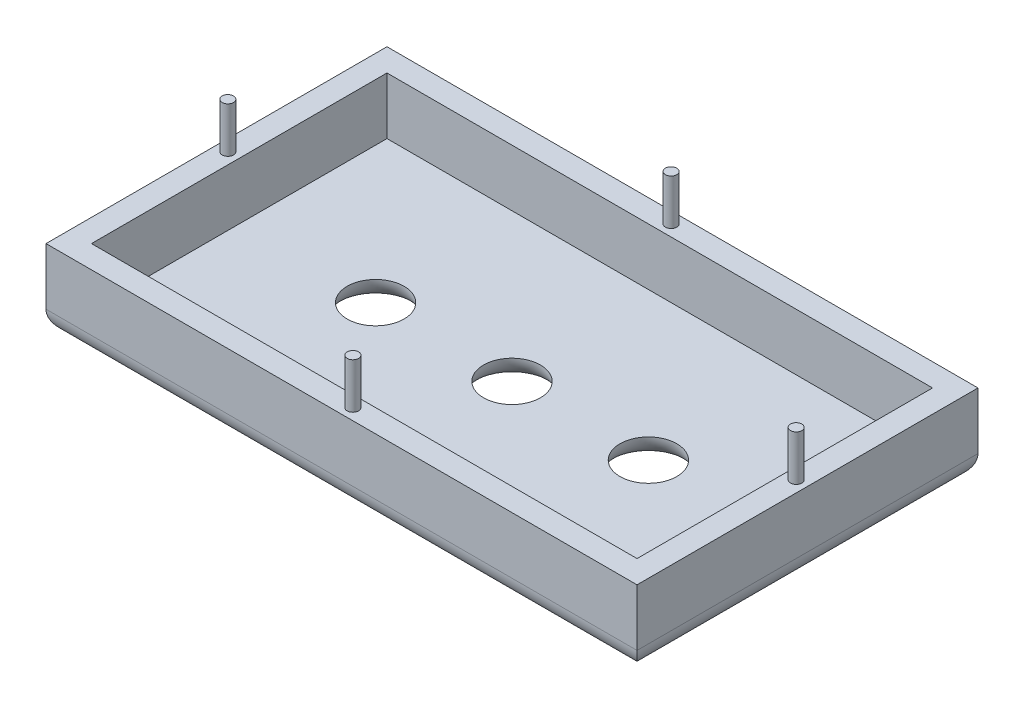
ISO-10303-21;
HEADER;
FILE_DESCRIPTION(('STEP AP214'),'2;1');
FILE_NAME('part.step','',(''),(''),'','','');
FILE_SCHEMA(('AUTOMOTIVE_DESIGN { 1 0 10303 214 1 1 1 1 }'));
ENDSEC;
DATA;
#1=APPLICATION_CONTEXT('core data for automotive mechanical design processes');
#2=APPLICATION_PROTOCOL_DEFINITION('international standard','automotive_design',2000,#1);
#3=PRODUCT_CONTEXT('',#1,'mechanical');
#4=PRODUCT('Part','Part','',(#3));
#5=PRODUCT_RELATED_PRODUCT_CATEGORY('part','',(#4));
#6=PRODUCT_DEFINITION_FORMATION('','',#4);
#7=PRODUCT_DEFINITION_CONTEXT('part definition',#1,'design');
#8=PRODUCT_DEFINITION('design','',#6,#7);
#9=PRODUCT_DEFINITION_SHAPE('','',#8);
#10=(LENGTH_UNIT() NAMED_UNIT(*) SI_UNIT(.MILLI.,.METRE.));
#11=(NAMED_UNIT(*) PLANE_ANGLE_UNIT() SI_UNIT($,.RADIAN.));
#12=(NAMED_UNIT(*) SI_UNIT($,.STERADIAN.) SOLID_ANGLE_UNIT());
#13=UNCERTAINTY_MEASURE_WITH_UNIT(LENGTH_MEASURE(1.E-05),#10,'distance_accuracy_value','');
#14=(GEOMETRIC_REPRESENTATION_CONTEXT(3) GLOBAL_UNCERTAINTY_ASSIGNED_CONTEXT((#13)) GLOBAL_UNIT_ASSIGNED_CONTEXT((#10,
#11,#12)) REPRESENTATION_CONTEXT('',''));
#15=CARTESIAN_POINT('',(0.,0.,0.));
#16=DIRECTION('',(0.,0.,1.));
#17=DIRECTION('',(1.,0.,0.));
#18=AXIS2_PLACEMENT_3D('',#15,#16,#17);
#19=CARTESIAN_POINT('',(0.,17.78,0.));
#20=DIRECTION('',(1.,0.,0.));
#21=DIRECTION('',(0.,0.,-1.));
#22=AXIS2_PLACEMENT_3D('',#19,#20,#21);
#23=PLANE('',#22);
#24=DIRECTION('',(0.,-1.,0.));
#25=VECTOR('',#24,1.);
#26=CARTESIAN_POINT('',(0.,17.78,-38.1));
#27=LINE('',#26,#25);
#28=CARTESIAN_POINT('',(0.,8.89,-38.1));
#29=VERTEX_POINT('',#28);
#30=CARTESIAN_POINT('',(0.,2.54,-38.1));
#31=VERTEX_POINT('',#30);
#32=EDGE_CURVE('E262',#29,#31,#27,.T.);
#33=ORIENTED_EDGE('',*,*,#32,.T.);
#34=DIRECTION('',(0.,0.,1.));
#35=VECTOR('',#34,1.);
#36=CARTESIAN_POINT('',(0.,2.54,0.));
#37=LINE('',#36,#35);
#38=CARTESIAN_POINT('',(0.,2.54,0.));
#39=VERTEX_POINT('',#38);
#40=EDGE_CURVE('E12',#31,#39,#37,.T.);
#41=ORIENTED_EDGE('',*,*,#40,.T.);
#42=DIRECTION('',(0.,-1.,0.));
#43=VECTOR('',#42,1.);
#44=CARTESIAN_POINT('',(0.,17.78,0.));
#45=LINE('',#44,#43);
#46=CARTESIAN_POINT('',(0.,8.89,0.));
#47=VERTEX_POINT('',#46);
#48=EDGE_CURVE('E153',#47,#39,#45,.T.);
#49=ORIENTED_EDGE('',*,*,#48,.F.);
#50=DIRECTION('',(0.,0.,-1.));
#51=VECTOR('',#50,1.);
#52=CARTESIAN_POINT('',(0.,8.89,0.));
#53=LINE('',#52,#51);
#54=EDGE_CURVE('E136',#47,#29,#53,.T.);
#55=ORIENTED_EDGE('',*,*,#54,.T.);
#56=EDGE_LOOP('',(#33,#41,#49,#55));
#57=FACE_BOUND('',#56,.T.);
#58=ADVANCED_FACE('F57',(#57),#23,.F.);
#59=CARTESIAN_POINT('',(0.,17.78,0.));
#60=DIRECTION('',(0.,0.,-1.));
#61=DIRECTION('',(-1.,0.,0.));
#62=AXIS2_PLACEMENT_3D('',#59,#60,#61);
#63=PLANE('',#62);
#64=ORIENTED_EDGE('',*,*,#48,.T.);
#65=DIRECTION('',(1.,0.,0.));
#66=VECTOR('',#65,1.);
#67=CARTESIAN_POINT('',(66.04,2.54,0.));
#68=LINE('',#67,#66);
#69=CARTESIAN_POINT('',(66.04,2.54,0.));
#70=VERTEX_POINT('',#69);
#71=EDGE_CURVE('E178',#39,#70,#68,.T.);
#72=ORIENTED_EDGE('',*,*,#71,.T.);
#73=DIRECTION('',(0.,-1.,0.));
#74=VECTOR('',#73,1.);
#75=CARTESIAN_POINT('',(66.04,17.78,0.));
#76=LINE('',#75,#74);
#77=CARTESIAN_POINT('',(66.04,8.89,0.));
#78=VERTEX_POINT('',#77);
#79=EDGE_CURVE('E155',#78,#70,#76,.T.);
#80=ORIENTED_EDGE('',*,*,#79,.F.);
#81=DIRECTION('',(1.,0.,0.));
#82=VECTOR('',#81,1.);
#83=CARTESIAN_POINT('',(0.,8.89,0.));
#84=LINE('',#83,#82);
#85=EDGE_CURVE('E140',#47,#78,#84,.T.);
#86=ORIENTED_EDGE('',*,*,#85,.F.);
#87=EDGE_LOOP('',(#64,#72,#80,#86));
#88=FACE_BOUND('',#87,.T.);
#89=ADVANCED_FACE('F151',(#88),#63,.F.);
#90=CARTESIAN_POINT('',(66.04,17.78,0.));
#91=DIRECTION('',(-1.,0.,0.));
#92=DIRECTION('',(0.,0.,1.));
#93=AXIS2_PLACEMENT_3D('',#90,#91,#92);
#94=PLANE('',#93);
#95=ORIENTED_EDGE('',*,*,#79,.T.);
#96=DIRECTION('',(0.,0.,-1.));
#97=VECTOR('',#96,1.);
#98=CARTESIAN_POINT('',(66.04,2.54,-38.1));
#99=LINE('',#98,#97);
#100=CARTESIAN_POINT('',(66.04,2.54,-38.1));
#101=VERTEX_POINT('',#100);
#102=EDGE_CURVE('E81',#70,#101,#99,.T.);
#103=ORIENTED_EDGE('',*,*,#102,.T.);
#104=DIRECTION('',(0.,-1.,0.));
#105=VECTOR('',#104,1.);
#106=CARTESIAN_POINT('',(66.04,17.78,-38.1));
#107=LINE('',#106,#105);
#108=CARTESIAN_POINT('',(66.04,8.89,-38.1));
#109=VERTEX_POINT('',#108);
#110=EDGE_CURVE('E163',#109,#101,#107,.T.);
#111=ORIENTED_EDGE('',*,*,#110,.F.);
#112=DIRECTION('',(0.,0.,-1.));
#113=VECTOR('',#112,1.);
#114=CARTESIAN_POINT('',(66.04,8.89,0.));
#115=LINE('',#114,#113);
#116=EDGE_CURVE('E146',#78,#109,#115,.T.);
#117=ORIENTED_EDGE('',*,*,#116,.F.);
#118=EDGE_LOOP('',(#95,#103,#111,#117));
#119=FACE_BOUND('',#118,.T.);
#120=ADVANCED_FACE('F281',(#119),#94,.F.);
#121=CARTESIAN_POINT('',(0.,17.78,-38.1));
#122=DIRECTION('',(0.,0.,1.));
#123=DIRECTION('',(1.,0.,0.));
#124=AXIS2_PLACEMENT_3D('',#121,#122,#123);
#125=PLANE('',#124);
#126=ORIENTED_EDGE('',*,*,#110,.T.);
#127=DIRECTION('',(-1.,0.,0.));
#128=VECTOR('',#127,1.);
#129=CARTESIAN_POINT('',(0.,2.54,-38.1));
#130=LINE('',#129,#128);
#131=EDGE_CURVE('E66',#101,#31,#130,.T.);
#132=ORIENTED_EDGE('',*,*,#131,.T.);
#133=ORIENTED_EDGE('',*,*,#32,.F.);
#134=DIRECTION('',(1.,0.,0.));
#135=VECTOR('',#134,1.);
#136=CARTESIAN_POINT('',(0.,8.89,-38.1));
#137=LINE('',#136,#135);
#138=EDGE_CURVE('E143',#29,#109,#137,.T.);
#139=ORIENTED_EDGE('',*,*,#138,.T.);
#140=EDGE_LOOP('',(#126,#132,#133,#139));
#141=FACE_BOUND('',#140,.T.);
#142=ADVANCED_FACE('F271',(#141),#125,.F.);
#143=CARTESIAN_POINT('',(0.,0.,0.));
#144=DIRECTION('',(0.,-1.,0.));
#145=DIRECTION('',(0.,0.,-1.));
#146=AXIS2_PLACEMENT_3D('',#143,#144,#145);
#147=PLANE('',#146);
#148=DIRECTION('',(0.,0.,-1.));
#149=VECTOR('',#148,1.);
#150=CARTESIAN_POINT('',(63.5,0.,0.));
#151=LINE('',#150,#149);
#152=CARTESIAN_POINT('',(63.5,0.,-35.56));
#153=VERTEX_POINT('',#152);
#154=CARTESIAN_POINT('',(63.5,0.,-2.54));
#155=VERTEX_POINT('',#154);
#156=EDGE_CURVE('E193',#153,#155,#151,.F.);
#157=ORIENTED_EDGE('',*,*,#156,.T.);
#158=DIRECTION('',(1.,0.,0.));
#159=VECTOR('',#158,1.);
#160=CARTESIAN_POINT('',(0.,0.,-2.54));
#161=LINE('',#160,#159);
#162=CARTESIAN_POINT('',(2.54,0.,-2.54));
#163=VERTEX_POINT('',#162);
#164=EDGE_CURVE('E195',#155,#163,#161,.F.);
#165=ORIENTED_EDGE('',*,*,#164,.T.);
#166=DIRECTION('',(0.,0.,1.));
#167=VECTOR('',#166,1.);
#168=CARTESIAN_POINT('',(2.54,0.,-38.1));
#169=LINE('',#168,#167);
#170=CARTESIAN_POINT('',(2.54,0.,-35.56));
#171=VERTEX_POINT('',#170);
#172=EDGE_CURVE('E189',#163,#171,#169,.F.);
#173=ORIENTED_EDGE('',*,*,#172,.T.);
#174=DIRECTION('',(-1.,0.,0.));
#175=VECTOR('',#174,1.);
#176=CARTESIAN_POINT('',(66.04,0.,-35.56));
#177=LINE('',#176,#175);
#178=EDGE_CURVE('E191',#171,#153,#177,.F.);
#179=ORIENTED_EDGE('',*,*,#178,.T.);
#180=EDGE_LOOP('',(#157,#165,#173,#179));
#181=FACE_BOUND('',#180,.T.);
#182=CARTESIAN_POINT('',(48.26,0.,-19.05));
#183=DIRECTION('',(0.,-1.,0.));
#184=DIRECTION('',(0.,0.,-1.));
#185=AXIS2_PLACEMENT_3D('',#182,#183,#184);
#186=CIRCLE('',#185,5.715);
#187=CARTESIAN_POINT('',(48.26,0.,-24.765));
#188=VERTEX_POINT('',#187);
#189=EDGE_CURVE('E186',#188,#188,#186,.F.);
#190=ORIENTED_EDGE('',*,*,#189,.T.);
#191=EDGE_LOOP('',(#190));
#192=FACE_BOUND('',#191,.T.);
#193=CARTESIAN_POINT('',(33.02,0.,-19.05));
#194=DIRECTION('',(0.,-1.,0.));
#195=DIRECTION('',(0.,0.,-1.));
#196=AXIS2_PLACEMENT_3D('',#193,#194,#195);
#197=CIRCLE('',#196,5.715);
#198=CARTESIAN_POINT('',(33.02,0.,-24.765));
#199=VERTEX_POINT('',#198);
#200=EDGE_CURVE('E183',#199,#199,#197,.F.);
#201=ORIENTED_EDGE('',*,*,#200,.T.);
#202=EDGE_LOOP('',(#201));
#203=FACE_BOUND('',#202,.T.);
#204=CARTESIAN_POINT('',(17.78,0.,-19.05));
#205=DIRECTION('',(0.,-1.,0.));
#206=DIRECTION('',(0.,0.,-1.));
#207=AXIS2_PLACEMENT_3D('',#204,#205,#206);
#208=CIRCLE('',#207,5.715);
#209=CARTESIAN_POINT('',(17.78,0.,-24.765));
#210=VERTEX_POINT('',#209);
#211=EDGE_CURVE('E180',#210,#210,#208,.F.);
#212=ORIENTED_EDGE('',*,*,#211,.T.);
#213=EDGE_LOOP('',(#212));
#214=FACE_BOUND('',#213,.T.);
#215=ADVANCED_FACE('F288',(#181,#192,#203,#214),#147,.T.);
#216=CARTESIAN_POINT('',(0.,8.89,0.));
#217=DIRECTION('',(0.,-1.,0.));
#218=DIRECTION('',(0.,0.,-1.));
#219=AXIS2_PLACEMENT_3D('',#216,#217,#218);
#220=PLANE('',#219);
#221=CARTESIAN_POINT('',(64.77,8.89,-19.05));
#222=DIRECTION('',(0.,-1.,0.));
#223=DIRECTION('',(0.,0.,-1.));
#224=AXIS2_PLACEMENT_3D('',#221,#222,#223);
#225=CIRCLE('',#224,0.635000000000002);
#226=CARTESIAN_POINT('',(64.77,8.89,-19.685));
#227=VERTEX_POINT('',#226);
#228=EDGE_CURVE('E175',#227,#227,#225,.F.);
#229=ORIENTED_EDGE('',*,*,#228,.F.);
#230=EDGE_LOOP('',(#229));
#231=FACE_BOUND('',#230,.T.);
#232=CARTESIAN_POINT('',(1.27,8.89,-19.05));
#233=DIRECTION('',(0.,-1.,0.));
#234=DIRECTION('',(0.,0.,-1.));
#235=AXIS2_PLACEMENT_3D('',#232,#233,#234);
#236=CIRCLE('',#235,0.634999999999999);
#237=CARTESIAN_POINT('',(1.27,8.89,-19.685));
#238=VERTEX_POINT('',#237);
#239=EDGE_CURVE('E172',#238,#238,#236,.F.);
#240=ORIENTED_EDGE('',*,*,#239,.F.);
#241=EDGE_LOOP('',(#240));
#242=FACE_BOUND('',#241,.T.);
#243=CARTESIAN_POINT('',(33.02,8.89,-1.27));
#244=DIRECTION('',(0.,-1.,0.));
#245=DIRECTION('',(0.,0.,-1.));
#246=AXIS2_PLACEMENT_3D('',#243,#244,#245);
#247=CIRCLE('',#246,0.634999999999995);
#248=CARTESIAN_POINT('',(33.02,8.89,-1.905));
#249=VERTEX_POINT('',#248);
#250=EDGE_CURVE('E169',#249,#249,#247,.F.);
#251=ORIENTED_EDGE('',*,*,#250,.F.);
#252=EDGE_LOOP('',(#251));
#253=FACE_BOUND('',#252,.T.);
#254=CARTESIAN_POINT('',(33.02,8.89,-36.83));
#255=DIRECTION('',(0.,-1.,0.));
#256=DIRECTION('',(0.,0.,-1.));
#257=AXIS2_PLACEMENT_3D('',#254,#255,#256);
#258=CIRCLE('',#257,0.634999999999996);
#259=CARTESIAN_POINT('',(33.02,8.89,-37.465));
#260=VERTEX_POINT('',#259);
#261=EDGE_CURVE('E161',#260,#260,#258,.F.);
#262=ORIENTED_EDGE('',*,*,#261,.F.);
#263=EDGE_LOOP('',(#262));
#264=FACE_BOUND('',#263,.T.);
#265=ORIENTED_EDGE('',*,*,#116,.T.);
#266=ORIENTED_EDGE('',*,*,#138,.F.);
#267=ORIENTED_EDGE('',*,*,#54,.F.);
#268=ORIENTED_EDGE('',*,*,#85,.T.);
#269=EDGE_LOOP('',(#265,#266,#267,#268));
#270=FACE_BOUND('',#269,.T.);
#271=DIRECTION('',(-1.,0.,0.));
#272=VECTOR('',#271,1.);
#273=CARTESIAN_POINT('',(2.54,8.89,-35.56));
#274=LINE('',#273,#272);
#275=CARTESIAN_POINT('',(63.5,8.89,-35.56));
#276=VERTEX_POINT('',#275);
#277=CARTESIAN_POINT('',(2.54,8.89,-35.56));
#278=VERTEX_POINT('',#277);
#279=EDGE_CURVE('E240',#276,#278,#274,.T.);
#280=ORIENTED_EDGE('',*,*,#279,.F.);
#281=DIRECTION('',(0.,0.,-1.));
#282=VECTOR('',#281,1.);
#283=CARTESIAN_POINT('',(63.5,8.89,-35.56));
#284=LINE('',#283,#282);
#285=CARTESIAN_POINT('',(63.5,8.89,-2.54));
#286=VERTEX_POINT('',#285);
#287=EDGE_CURVE('E236',#286,#276,#284,.T.);
#288=ORIENTED_EDGE('',*,*,#287,.F.);
#289=DIRECTION('',(1.,0.,0.));
#290=VECTOR('',#289,1.);
#291=CARTESIAN_POINT('',(2.54,8.89,-2.54));
#292=LINE('',#291,#290);
#293=CARTESIAN_POINT('',(2.54,8.89,-2.54));
#294=VERTEX_POINT('',#293);
#295=EDGE_CURVE('E158',#294,#286,#292,.T.);
#296=ORIENTED_EDGE('',*,*,#295,.F.);
#297=DIRECTION('',(0.,0.,1.));
#298=VECTOR('',#297,1.);
#299=CARTESIAN_POINT('',(2.54,8.89,-35.56));
#300=LINE('',#299,#298);
#301=EDGE_CURVE('E243',#278,#294,#300,.T.);
#302=ORIENTED_EDGE('',*,*,#301,.F.);
#303=EDGE_LOOP('',(#280,#288,#296,#302));
#304=FACE_BOUND('',#303,.T.);
#305=ADVANCED_FACE('F138',(#231,#242,#253,#264,#270,#304),#220,.F.);
#306=CARTESIAN_POINT('',(0.,2.54,0.));
#307=DIRECTION('',(0.,1.,0.));
#308=DIRECTION('',(0.,0.,1.));
#309=AXIS2_PLACEMENT_3D('',#306,#307,#308);
#310=PLANE('',#309);
#311=CARTESIAN_POINT('',(17.78,2.54,-19.05));
#312=DIRECTION('',(0.,-1.,0.));
#313=DIRECTION('',(0.,0.,-1.));
#314=AXIS2_PLACEMENT_3D('',#311,#312,#313);
#315=CIRCLE('',#314,3.175);
#316=CARTESIAN_POINT('',(17.78,2.54,-22.225));
#317=VERTEX_POINT('',#316);
#318=EDGE_CURVE('E219',#317,#317,#315,.T.);
#319=ORIENTED_EDGE('',*,*,#318,.T.);
#320=EDGE_LOOP('',(#319));
#321=FACE_BOUND('',#320,.T.);
#322=CARTESIAN_POINT('',(33.02,2.54,-19.05));
#323=DIRECTION('',(0.,-1.,0.));
#324=DIRECTION('',(0.,0.,-1.));
#325=AXIS2_PLACEMENT_3D('',#322,#323,#324);
#326=CIRCLE('',#325,3.175);
#327=CARTESIAN_POINT('',(33.02,2.54,-22.225));
#328=VERTEX_POINT('',#327);
#329=EDGE_CURVE('E214',#328,#328,#326,.T.);
#330=ORIENTED_EDGE('',*,*,#329,.T.);
#331=EDGE_LOOP('',(#330));
#332=FACE_BOUND('',#331,.T.);
#333=CARTESIAN_POINT('',(48.26,2.54,-19.05));
#334=DIRECTION('',(0.,-1.,0.));
#335=DIRECTION('',(0.,0.,-1.));
#336=AXIS2_PLACEMENT_3D('',#333,#334,#335);
#337=CIRCLE('',#336,3.175);
#338=CARTESIAN_POINT('',(48.26,2.54,-22.225));
#339=VERTEX_POINT('',#338);
#340=EDGE_CURVE('E209',#339,#339,#337,.T.);
#341=ORIENTED_EDGE('',*,*,#340,.T.);
#342=EDGE_LOOP('',(#341));
#343=FACE_BOUND('',#342,.T.);
#344=DIRECTION('',(0.,0.,1.));
#345=VECTOR('',#344,1.);
#346=CARTESIAN_POINT('',(2.54,2.54,-35.56));
#347=LINE('',#346,#345);
#348=CARTESIAN_POINT('',(2.54,2.54,-35.56));
#349=VERTEX_POINT('',#348);
#350=CARTESIAN_POINT('',(2.54,2.54,-2.54));
#351=VERTEX_POINT('',#350);
#352=EDGE_CURVE('E246',#349,#351,#347,.T.);
#353=ORIENTED_EDGE('',*,*,#352,.T.);
#354=DIRECTION('',(1.,0.,0.));
#355=VECTOR('',#354,1.);
#356=CARTESIAN_POINT('',(2.54,2.54,-2.54));
#357=LINE('',#356,#355);
#358=CARTESIAN_POINT('',(63.5,2.54,-2.54));
#359=VERTEX_POINT('',#358);
#360=EDGE_CURVE('E249',#351,#359,#357,.T.);
#361=ORIENTED_EDGE('',*,*,#360,.T.);
#362=DIRECTION('',(0.,0.,-1.));
#363=VECTOR('',#362,1.);
#364=CARTESIAN_POINT('',(63.5,2.54,-35.56));
#365=LINE('',#364,#363);
#366=CARTESIAN_POINT('',(63.5,2.54,-35.56));
#367=VERTEX_POINT('',#366);
#368=EDGE_CURVE('E252',#359,#367,#365,.T.);
#369=ORIENTED_EDGE('',*,*,#368,.T.);
#370=DIRECTION('',(-1.,0.,0.));
#371=VECTOR('',#370,1.);
#372=CARTESIAN_POINT('',(2.54,2.54,-35.56));
#373=LINE('',#372,#371);
#374=EDGE_CURVE('E255',#367,#349,#373,.T.);
#375=ORIENTED_EDGE('',*,*,#374,.T.);
#376=EDGE_LOOP('',(#353,#361,#369,#375));
#377=FACE_BOUND('',#376,.T.);
#378=ADVANCED_FACE('F321',(#321,#332,#343,#377),#310,.T.);
#379=CARTESIAN_POINT('',(2.54,2.54,-2.54));
#380=DIRECTION('',(0.,0.,1.));
#381=DIRECTION('',(1.,0.,0.));
#382=AXIS2_PLACEMENT_3D('',#379,#380,#381);
#383=PLANE('',#382);
#384=DIRECTION('',(0.,1.,0.));
#385=VECTOR('',#384,1.);
#386=CARTESIAN_POINT('',(2.54,2.54,-2.54));
#387=LINE('',#386,#385);
#388=EDGE_CURVE('E258',#351,#294,#387,.T.);
#389=ORIENTED_EDGE('',*,*,#388,.T.);
#390=ORIENTED_EDGE('',*,*,#295,.T.);
#391=DIRECTION('',(0.,1.,0.));
#392=VECTOR('',#391,1.);
#393=CARTESIAN_POINT('',(63.5,2.54,-2.54));
#394=LINE('',#393,#392);
#395=EDGE_CURVE('E266',#359,#286,#394,.T.);
#396=ORIENTED_EDGE('',*,*,#395,.F.);
#397=ORIENTED_EDGE('',*,*,#360,.F.);
#398=EDGE_LOOP('',(#389,#390,#396,#397));
#399=FACE_BOUND('',#398,.T.);
#400=ADVANCED_FACE('F322',(#399),#383,.F.);
#401=CARTESIAN_POINT('',(63.5,2.54,-35.56));
#402=DIRECTION('',(1.,0.,0.));
#403=DIRECTION('',(0.,0.,-1.));
#404=AXIS2_PLACEMENT_3D('',#401,#402,#403);
#405=PLANE('',#404);
#406=ORIENTED_EDGE('',*,*,#395,.T.);
#407=ORIENTED_EDGE('',*,*,#287,.T.);
#408=DIRECTION('',(0.,1.,0.));
#409=VECTOR('',#408,1.);
#410=CARTESIAN_POINT('',(63.5,2.54,-35.56));
#411=LINE('',#410,#409);
#412=EDGE_CURVE('E263',#367,#276,#411,.T.);
#413=ORIENTED_EDGE('',*,*,#412,.F.);
#414=ORIENTED_EDGE('',*,*,#368,.F.);
#415=EDGE_LOOP('',(#406,#407,#413,#414));
#416=FACE_BOUND('',#415,.T.);
#417=ADVANCED_FACE('F334',(#416),#405,.F.);
#418=CARTESIAN_POINT('',(2.54,2.54,-35.56));
#419=DIRECTION('',(0.,0.,-1.));
#420=DIRECTION('',(-1.,0.,0.));
#421=AXIS2_PLACEMENT_3D('',#418,#419,#420);
#422=PLANE('',#421);
#423=ORIENTED_EDGE('',*,*,#412,.T.);
#424=ORIENTED_EDGE('',*,*,#279,.T.);
#425=DIRECTION('',(0.,1.,0.));
#426=VECTOR('',#425,1.);
#427=CARTESIAN_POINT('',(2.54,2.54,-35.56));
#428=LINE('',#427,#426);
#429=EDGE_CURVE('E259',#349,#278,#428,.T.);
#430=ORIENTED_EDGE('',*,*,#429,.F.);
#431=ORIENTED_EDGE('',*,*,#374,.F.);
#432=EDGE_LOOP('',(#423,#424,#430,#431));
#433=FACE_BOUND('',#432,.T.);
#434=ADVANCED_FACE('F336',(#433),#422,.F.);
#435=CARTESIAN_POINT('',(2.54,2.54,-35.56));
#436=DIRECTION('',(-1.,0.,0.));
#437=DIRECTION('',(0.,0.,1.));
#438=AXIS2_PLACEMENT_3D('',#435,#436,#437);
#439=PLANE('',#438);
#440=ORIENTED_EDGE('',*,*,#429,.T.);
#441=ORIENTED_EDGE('',*,*,#301,.T.);
#442=ORIENTED_EDGE('',*,*,#388,.F.);
#443=ORIENTED_EDGE('',*,*,#352,.F.);
#444=EDGE_LOOP('',(#440,#441,#442,#443));
#445=FACE_BOUND('',#444,.T.);
#446=ADVANCED_FACE('F330',(#445),#439,.F.);
#447=CARTESIAN_POINT('',(33.02,13.97,-36.83));
#448=DIRECTION('',(0.,-1.,0.));
#449=DIRECTION('',(0.,0.,-1.));
#450=AXIS2_PLACEMENT_3D('',#447,#448,#449);
#451=CYLINDRICAL_SURFACE('',#450,0.634999999999996);
#452=CARTESIAN_POINT('',(33.02,13.97,-36.83));
#453=DIRECTION('',(0.,1.,0.));
#454=DIRECTION('',(0.,0.,1.));
#455=AXIS2_PLACEMENT_3D('',#452,#453,#454);
#456=CIRCLE('',#455,0.634999999999996);
#457=CARTESIAN_POINT('',(33.02,13.97,-36.195));
#458=VERTEX_POINT('',#457);
#459=EDGE_CURVE('E232',#458,#458,#456,.T.);
#460=ORIENTED_EDGE('',*,*,#459,.F.);
#461=EDGE_LOOP('',(#460));
#462=FACE_BOUND('',#461,.T.);
#463=ORIENTED_EDGE('',*,*,#261,.T.);
#464=EDGE_LOOP('',(#463));
#465=FACE_BOUND('',#464,.T.);
#466=ADVANCED_FACE('F350',(#462,#465),#451,.T.);
#467=CARTESIAN_POINT('',(33.02,13.97,-36.83));
#468=DIRECTION('',(0.,1.,0.));
#469=DIRECTION('',(0.,0.,1.));
#470=AXIS2_PLACEMENT_3D('',#467,#468,#469);
#471=PLANE('',#470);
#472=ORIENTED_EDGE('',*,*,#459,.T.);
#473=EDGE_LOOP('',(#472));
#474=FACE_BOUND('',#473,.T.);
#475=ADVANCED_FACE('F363',(#474),#471,.T.);
#476=CARTESIAN_POINT('',(33.02,13.97,-1.27));
#477=DIRECTION('',(0.,-1.,0.));
#478=DIRECTION('',(0.,0.,-1.));
#479=AXIS2_PLACEMENT_3D('',#476,#477,#478);
#480=CYLINDRICAL_SURFACE('',#479,0.634999999999995);
#481=CARTESIAN_POINT('',(33.02,13.97,-1.27));
#482=DIRECTION('',(0.,1.,0.));
#483=DIRECTION('',(0.,0.,1.));
#484=AXIS2_PLACEMENT_3D('',#481,#482,#483);
#485=CIRCLE('',#484,0.634999999999995);
#486=CARTESIAN_POINT('',(33.02,13.97,-0.635000000000005));
#487=VERTEX_POINT('',#486);
#488=EDGE_CURVE('E229',#487,#487,#485,.T.);
#489=ORIENTED_EDGE('',*,*,#488,.F.);
#490=EDGE_LOOP('',(#489));
#491=FACE_BOUND('',#490,.T.);
#492=ORIENTED_EDGE('',*,*,#250,.T.);
#493=EDGE_LOOP('',(#492));
#494=FACE_BOUND('',#493,.T.);
#495=ADVANCED_FACE('F368',(#491,#494),#480,.T.);
#496=CARTESIAN_POINT('',(33.02,13.97,-1.27));
#497=DIRECTION('',(0.,1.,0.));
#498=DIRECTION('',(0.,0.,1.));
#499=AXIS2_PLACEMENT_3D('',#496,#497,#498);
#500=PLANE('',#499);
#501=ORIENTED_EDGE('',*,*,#488,.T.);
#502=EDGE_LOOP('',(#501));
#503=FACE_BOUND('',#502,.T.);
#504=ADVANCED_FACE('F377',(#503),#500,.T.);
#505=CARTESIAN_POINT('',(1.27,13.97,-19.05));
#506=DIRECTION('',(0.,-1.,0.));
#507=DIRECTION('',(0.,0.,-1.));
#508=AXIS2_PLACEMENT_3D('',#505,#506,#507);
#509=CYLINDRICAL_SURFACE('',#508,0.634999999999999);
#510=CARTESIAN_POINT('',(1.27,13.97,-19.05));
#511=DIRECTION('',(0.,1.,0.));
#512=DIRECTION('',(0.,0.,1.));
#513=AXIS2_PLACEMENT_3D('',#510,#511,#512);
#514=CIRCLE('',#513,0.634999999999999);
#515=CARTESIAN_POINT('',(1.27,13.97,-18.415));
#516=VERTEX_POINT('',#515);
#517=EDGE_CURVE('E226',#516,#516,#514,.T.);
#518=ORIENTED_EDGE('',*,*,#517,.F.);
#519=EDGE_LOOP('',(#518));
#520=FACE_BOUND('',#519,.T.);
#521=ORIENTED_EDGE('',*,*,#239,.T.);
#522=EDGE_LOOP('',(#521));
#523=FACE_BOUND('',#522,.T.);
#524=ADVANCED_FACE('F383',(#520,#523),#509,.T.);
#525=CARTESIAN_POINT('',(1.27,13.97,-19.05));
#526=DIRECTION('',(0.,1.,0.));
#527=DIRECTION('',(0.,0.,1.));
#528=AXIS2_PLACEMENT_3D('',#525,#526,#527);
#529=PLANE('',#528);
#530=ORIENTED_EDGE('',*,*,#517,.T.);
#531=EDGE_LOOP('',(#530));
#532=FACE_BOUND('',#531,.T.);
#533=ADVANCED_FACE('F387',(#532),#529,.T.);
#534=CARTESIAN_POINT('',(64.77,13.97,-19.05));
#535=DIRECTION('',(0.,-1.,0.));
#536=DIRECTION('',(0.,0.,-1.));
#537=AXIS2_PLACEMENT_3D('',#534,#535,#536);
#538=CYLINDRICAL_SURFACE('',#537,0.635000000000002);
#539=CARTESIAN_POINT('',(64.77,13.97,-19.05));
#540=DIRECTION('',(0.,1.,0.));
#541=DIRECTION('',(0.,0.,1.));
#542=AXIS2_PLACEMENT_3D('',#539,#540,#541);
#543=CIRCLE('',#542,0.635000000000002);
#544=CARTESIAN_POINT('',(64.77,13.97,-18.415));
#545=VERTEX_POINT('',#544);
#546=EDGE_CURVE('E223',#545,#545,#543,.T.);
#547=ORIENTED_EDGE('',*,*,#546,.F.);
#548=EDGE_LOOP('',(#547));
#549=FACE_BOUND('',#548,.T.);
#550=ORIENTED_EDGE('',*,*,#228,.T.);
#551=EDGE_LOOP('',(#550));
#552=FACE_BOUND('',#551,.T.);
#553=ADVANCED_FACE('F391',(#549,#552),#538,.T.);
#554=CARTESIAN_POINT('',(64.77,13.97,-19.05));
#555=DIRECTION('',(0.,1.,0.));
#556=DIRECTION('',(0.,0.,1.));
#557=AXIS2_PLACEMENT_3D('',#554,#555,#556);
#558=PLANE('',#557);
#559=ORIENTED_EDGE('',*,*,#546,.T.);
#560=EDGE_LOOP('',(#559));
#561=FACE_BOUND('',#560,.T.);
#562=ADVANCED_FACE('F307',(#561),#558,.T.);
#563=CARTESIAN_POINT('',(0.,2.54,-35.56));
#564=DIRECTION('',(1.,0.,0.));
#565=DIRECTION('',(0.,0.,-1.));
#566=AXIS2_PLACEMENT_3D('',#563,#564,#565);
#567=CYLINDRICAL_SURFACE('',#566,2.54);
#568=CARTESIAN_POINT('',(63.5,2.54,-35.56));
#569=DIRECTION('',(0.707106781186547,0.,0.707106781186547));
#570=DIRECTION('',(0.707106781186547,0.,-0.707106781186547));
#571=AXIS2_PLACEMENT_3D('',#568,#569,#570);
#572=ELLIPSE('',#571,3.59210244842766,2.54);
#573=EDGE_CURVE('E203',#153,#101,#572,.T.);
#574=ORIENTED_EDGE('',*,*,#573,.F.);
#575=ORIENTED_EDGE('',*,*,#178,.F.);
#576=CARTESIAN_POINT('',(2.54,2.54,-35.56));
#577=DIRECTION('',(0.707106781186547,0.,-0.707106781186547));
#578=DIRECTION('',(-0.707106781186547,0.,-0.707106781186547));
#579=AXIS2_PLACEMENT_3D('',#576,#577,#578);
#580=ELLIPSE('',#579,3.59210244842766,2.54);
#581=EDGE_CURVE('E61',#31,#171,#580,.F.);
#582=ORIENTED_EDGE('',*,*,#581,.F.);
#583=ORIENTED_EDGE('',*,*,#131,.F.);
#584=EDGE_LOOP('',(#574,#575,#582,#583));
#585=FACE_BOUND('',#584,.T.);
#586=ADVANCED_FACE('F273',(#585),#567,.T.);
#587=CARTESIAN_POINT('',(2.54,2.54,0.));
#588=DIRECTION('',(0.,0.,-1.));
#589=DIRECTION('',(-1.,0.,0.));
#590=AXIS2_PLACEMENT_3D('',#587,#588,#589);
#591=CYLINDRICAL_SURFACE('',#590,2.54);
#592=ORIENTED_EDGE('',*,*,#581,.T.);
#593=ORIENTED_EDGE('',*,*,#172,.F.);
#594=CARTESIAN_POINT('',(2.54,2.54,-2.54));
#595=DIRECTION('',(-0.707106781186547,0.,-0.707106781186547));
#596=DIRECTION('',(0.707106781186547,0.,-0.707106781186547));
#597=AXIS2_PLACEMENT_3D('',#594,#595,#596);
#598=ELLIPSE('',#597,3.59210244842766,2.54);
#599=EDGE_CURVE('E202',#39,#163,#598,.F.);
#600=ORIENTED_EDGE('',*,*,#599,.F.);
#601=ORIENTED_EDGE('',*,*,#40,.F.);
#602=EDGE_LOOP('',(#592,#593,#600,#601));
#603=FACE_BOUND('',#602,.T.);
#604=ADVANCED_FACE('F275',(#603),#591,.T.);
#605=CARTESIAN_POINT('',(63.5,2.54,0.));
#606=DIRECTION('',(0.,0.,1.));
#607=DIRECTION('',(1.,0.,0.));
#608=AXIS2_PLACEMENT_3D('',#605,#606,#607);
#609=CYLINDRICAL_SURFACE('',#608,2.54);
#610=ORIENTED_EDGE('',*,*,#573,.T.);
#611=ORIENTED_EDGE('',*,*,#102,.F.);
#612=CARTESIAN_POINT('',(63.5,2.54,-2.54));
#613=DIRECTION('',(-0.707106781186547,0.,0.707106781186547));
#614=DIRECTION('',(0.707106781186547,0.,0.707106781186547));
#615=AXIS2_PLACEMENT_3D('',#612,#613,#614);
#616=ELLIPSE('',#615,3.59210244842766,2.54);
#617=EDGE_CURVE('E200',#155,#70,#616,.T.);
#618=ORIENTED_EDGE('',*,*,#617,.F.);
#619=ORIENTED_EDGE('',*,*,#156,.F.);
#620=EDGE_LOOP('',(#610,#611,#618,#619));
#621=FACE_BOUND('',#620,.T.);
#622=ADVANCED_FACE('F300',(#621),#609,.T.);
#623=CARTESIAN_POINT('',(0.,2.54,-2.54));
#624=DIRECTION('',(-1.,0.,0.));
#625=DIRECTION('',(0.,0.,1.));
#626=AXIS2_PLACEMENT_3D('',#623,#624,#625);
#627=CYLINDRICAL_SURFACE('',#626,2.54);
#628=ORIENTED_EDGE('',*,*,#599,.T.);
#629=ORIENTED_EDGE('',*,*,#164,.F.);
#630=ORIENTED_EDGE('',*,*,#617,.T.);
#631=ORIENTED_EDGE('',*,*,#71,.F.);
#632=EDGE_LOOP('',(#628,#629,#630,#631));
#633=FACE_BOUND('',#632,.T.);
#634=ADVANCED_FACE('F279',(#633),#627,.T.);
#635=CARTESIAN_POINT('',(48.26,2.54,-19.05));
#636=DIRECTION('',(0.,-1.,0.));
#637=DIRECTION('',(0.,0.,-1.));
#638=AXIS2_PLACEMENT_3D('',#635,#636,#637);
#639=TOROIDAL_SURFACE('',#638,5.715,2.54);
#640=ORIENTED_EDGE('',*,*,#189,.F.);
#641=EDGE_LOOP('',(#640));
#642=FACE_BOUND('',#641,.T.);
#643=ORIENTED_EDGE('',*,*,#340,.F.);
#644=EDGE_LOOP('',(#643));
#645=FACE_BOUND('',#644,.T.);
#646=ADVANCED_FACE('F299',(#642,#645),#639,.T.);
#647=CARTESIAN_POINT('',(33.02,2.54,-19.05));
#648=DIRECTION('',(0.,-1.,0.));
#649=DIRECTION('',(0.,0.,-1.));
#650=AXIS2_PLACEMENT_3D('',#647,#648,#649);
#651=TOROIDAL_SURFACE('',#650,5.715,2.54);
#652=ORIENTED_EDGE('',*,*,#200,.F.);
#653=EDGE_LOOP('',(#652));
#654=FACE_BOUND('',#653,.T.);
#655=ORIENTED_EDGE('',*,*,#329,.F.);
#656=EDGE_LOOP('',(#655));
#657=FACE_BOUND('',#656,.T.);
#658=ADVANCED_FACE('F309',(#654,#657),#651,.T.);
#659=CARTESIAN_POINT('',(17.78,2.54,-19.05));
#660=DIRECTION('',(0.,-1.,0.));
#661=DIRECTION('',(0.,0.,-1.));
#662=AXIS2_PLACEMENT_3D('',#659,#660,#661);
#663=TOROIDAL_SURFACE('',#662,5.715,2.54);
#664=ORIENTED_EDGE('',*,*,#211,.F.);
#665=EDGE_LOOP('',(#664));
#666=FACE_BOUND('',#665,.T.);
#667=ORIENTED_EDGE('',*,*,#318,.F.);
#668=EDGE_LOOP('',(#667));
#669=FACE_BOUND('',#668,.T.);
#670=ADVANCED_FACE('F59',(#666,#669),#663,.T.);
#671=CLOSED_SHELL('',(#58,#89,#120,#142,#215,#305,#378,#400,#417,#434,#446,#466,#475,#495,#504,
#524,#533,#553,#562,#586,#604,#622,#634,#646,#658,#670));
#672=MANIFOLD_SOLID_BREP('B2',#671);
#673=ADVANCED_BREP_SHAPE_REPRESENTATION('',(#18,#672),#14);
#674=SHAPE_DEFINITION_REPRESENTATION(#9,#673);
ENDSEC;
END-ISO-10303-21;
